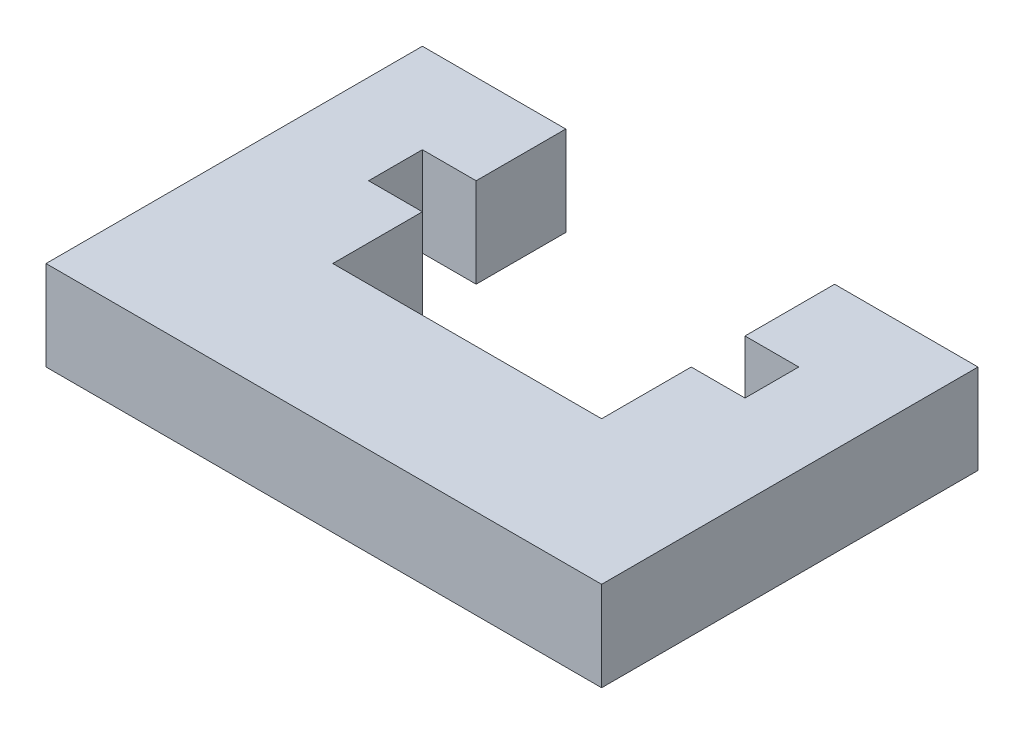
ISO-10303-21;
HEADER;
FILE_DESCRIPTION(('STEP AP214'),'2;1');
FILE_NAME('part.step','',(''),(''),'','','');
FILE_SCHEMA(('AUTOMOTIVE_DESIGN { 1 0 10303 214 1 1 1 1 }'));
ENDSEC;
DATA;
#1=APPLICATION_CONTEXT('core data for automotive mechanical design processes');
#2=APPLICATION_PROTOCOL_DEFINITION('international standard','automotive_design',2000,#1);
#3=PRODUCT_CONTEXT('',#1,'mechanical');
#4=PRODUCT('Part','Part','',(#3));
#5=PRODUCT_RELATED_PRODUCT_CATEGORY('part','',(#4));
#6=PRODUCT_DEFINITION_FORMATION('','',#4);
#7=PRODUCT_DEFINITION_CONTEXT('part definition',#1,'design');
#8=PRODUCT_DEFINITION('design','',#6,#7);
#9=PRODUCT_DEFINITION_SHAPE('','',#8);
#10=(LENGTH_UNIT() NAMED_UNIT(*) SI_UNIT(.MILLI.,.METRE.));
#11=(NAMED_UNIT(*) PLANE_ANGLE_UNIT() SI_UNIT($,.RADIAN.));
#12=(NAMED_UNIT(*) SI_UNIT($,.STERADIAN.) SOLID_ANGLE_UNIT());
#13=UNCERTAINTY_MEASURE_WITH_UNIT(LENGTH_MEASURE(1.E-05),#10,'distance_accuracy_value','');
#14=(GEOMETRIC_REPRESENTATION_CONTEXT(3) GLOBAL_UNCERTAINTY_ASSIGNED_CONTEXT((#13)) GLOBAL_UNIT_ASSIGNED_CONTEXT((#10,
#11,#12)) REPRESENTATION_CONTEXT('',''));
#15=CARTESIAN_POINT('',(0.,0.,0.));
#16=DIRECTION('',(0.,0.,1.));
#17=DIRECTION('',(1.,0.,0.));
#18=AXIS2_PLACEMENT_3D('',#15,#16,#17);
#19=CARTESIAN_POINT('',(23.,5.,-21.));
#20=DIRECTION('',(1.,0.,0.));
#21=DIRECTION('',(0.,0.,-1.));
#22=AXIS2_PLACEMENT_3D('',#19,#20,#21);
#23=PLANE('',#22);
#24=DIRECTION('',(0.,0.,1.));
#25=VECTOR('',#24,1.);
#26=CARTESIAN_POINT('',(23.,5.,-21.));
#27=LINE('',#26,#25);
#28=CARTESIAN_POINT('',(23.,5.,-13.));
#29=VERTEX_POINT('',#28);
#30=CARTESIAN_POINT('',(23.,5.,-8.));
#31=VERTEX_POINT('',#30);
#32=EDGE_CURVE('E262',#29,#31,#27,.T.);
#33=ORIENTED_EDGE('',*,*,#32,.F.);
#34=DIRECTION('',(0.,1.,0.));
#35=VECTOR('',#34,1.);
#36=CARTESIAN_POINT('',(23.,-0.00100000000000013,-13.));
#37=LINE('',#36,#35);
#38=CARTESIAN_POINT('',(23.,0.,-13.));
#39=VERTEX_POINT('',#38);
#40=EDGE_CURVE('E229',#39,#29,#37,.T.);
#41=ORIENTED_EDGE('',*,*,#40,.F.);
#42=DIRECTION('',(0.,0.,1.));
#43=VECTOR('',#42,1.);
#44=CARTESIAN_POINT('',(23.,0.,-21.));
#45=LINE('',#44,#43);
#46=CARTESIAN_POINT('',(23.,0.,-8.));
#47=VERTEX_POINT('',#46);
#48=EDGE_CURVE('E219',#39,#47,#45,.T.);
#49=ORIENTED_EDGE('',*,*,#48,.T.);
#50=DIRECTION('',(0.,-1.,0.));
#51=VECTOR('',#50,1.);
#52=CARTESIAN_POINT('',(23.,5.,-8.));
#53=LINE('',#52,#51);
#54=EDGE_CURVE('E188',#31,#47,#53,.T.);
#55=ORIENTED_EDGE('',*,*,#54,.F.);
#56=EDGE_LOOP('',(#33,#41,#49,#55));
#57=FACE_BOUND('',#56,.T.);
#58=ADVANCED_FACE('F35',(#57),#23,.F.);
#59=CARTESIAN_POINT('',(8.,5.,-8.));
#60=DIRECTION('',(-1.,0.,0.));
#61=DIRECTION('',(0.,0.,1.));
#62=AXIS2_PLACEMENT_3D('',#59,#60,#61);
#63=PLANE('',#62);
#64=DIRECTION('',(0.,0.,-1.));
#65=VECTOR('',#64,1.);
#66=CARTESIAN_POINT('',(8.,5.,-8.));
#67=LINE('',#66,#65);
#68=CARTESIAN_POINT('',(8.00000000000001,5.,-16.));
#69=VERTEX_POINT('',#68);
#70=CARTESIAN_POINT('',(8.,5.,-21.));
#71=VERTEX_POINT('',#70);
#72=EDGE_CURVE('E167',#69,#71,#67,.T.);
#73=ORIENTED_EDGE('',*,*,#72,.F.);
#74=DIRECTION('',(0.,1.,0.));
#75=VECTOR('',#74,1.);
#76=CARTESIAN_POINT('',(8.,-0.00100000000000013,-16.));
#77=LINE('',#76,#75);
#78=CARTESIAN_POINT('',(8.,0.,-16.));
#79=VERTEX_POINT('',#78);
#80=EDGE_CURVE('E152',#79,#69,#77,.T.);
#81=ORIENTED_EDGE('',*,*,#80,.F.);
#82=DIRECTION('',(0.,0.,-1.));
#83=VECTOR('',#82,1.);
#84=CARTESIAN_POINT('',(8.,0.,-8.));
#85=LINE('',#84,#83);
#86=CARTESIAN_POINT('',(8.,0.,-21.));
#87=VERTEX_POINT('',#86);
#88=EDGE_CURVE('E165',#79,#87,#85,.T.);
#89=ORIENTED_EDGE('',*,*,#88,.T.);
#90=DIRECTION('',(0.,-1.,0.));
#91=VECTOR('',#90,1.);
#92=CARTESIAN_POINT('',(8.,5.,-21.));
#93=LINE('',#92,#91);
#94=EDGE_CURVE('E182',#71,#87,#93,.T.);
#95=ORIENTED_EDGE('',*,*,#94,.F.);
#96=EDGE_LOOP('',(#73,#81,#89,#95));
#97=FACE_BOUND('',#96,.T.);
#98=ADVANCED_FACE('F163',(#97),#63,.F.);
#99=CARTESIAN_POINT('',(8.,5.,-21.));
#100=DIRECTION('',(0.,0.,1.));
#101=DIRECTION('',(1.,0.,0.));
#102=AXIS2_PLACEMENT_3D('',#99,#100,#101);
#103=PLANE('',#102);
#104=DIRECTION('',(-1.,0.,0.));
#105=VECTOR('',#104,1.);
#106=CARTESIAN_POINT('',(8.,0.,-21.));
#107=LINE('',#106,#105);
#108=CARTESIAN_POINT('',(0.,0.,-21.));
#109=VERTEX_POINT('',#108);
#110=EDGE_CURVE('E158',#87,#109,#107,.T.);
#111=ORIENTED_EDGE('',*,*,#110,.T.);
#112=DIRECTION('',(0.,-1.,0.));
#113=VECTOR('',#112,1.);
#114=CARTESIAN_POINT('',(0.,5.,-21.));
#115=LINE('',#114,#113);
#116=CARTESIAN_POINT('',(0.,5.,-21.));
#117=VERTEX_POINT('',#116);
#118=EDGE_CURVE('E11',#117,#109,#115,.T.);
#119=ORIENTED_EDGE('',*,*,#118,.F.);
#120=DIRECTION('',(-1.,0.,0.));
#121=VECTOR('',#120,1.);
#122=CARTESIAN_POINT('',(8.,5.,-21.));
#123=LINE('',#122,#121);
#124=EDGE_CURVE('E177',#71,#117,#123,.T.);
#125=ORIENTED_EDGE('',*,*,#124,.F.);
#126=ORIENTED_EDGE('',*,*,#94,.T.);
#127=EDGE_LOOP('',(#111,#119,#125,#126));
#128=FACE_BOUND('',#127,.T.);
#129=ADVANCED_FACE('F37',(#128),#103,.F.);
#130=CARTESIAN_POINT('',(0.,5.,-21.));
#131=DIRECTION('',(1.,0.,0.));
#132=DIRECTION('',(0.,0.,-1.));
#133=AXIS2_PLACEMENT_3D('',#130,#131,#132);
#134=PLANE('',#133);
#135=DIRECTION('',(0.,0.,1.));
#136=VECTOR('',#135,1.);
#137=CARTESIAN_POINT('',(0.,0.,-21.));
#138=LINE('',#137,#136);
#139=CARTESIAN_POINT('',(0.,0.,0.));
#140=VERTEX_POINT('',#139);
#141=EDGE_CURVE('E210',#109,#140,#138,.T.);
#142=ORIENTED_EDGE('',*,*,#141,.T.);
#143=DIRECTION('',(0.,-1.,0.));
#144=VECTOR('',#143,1.);
#145=CARTESIAN_POINT('',(0.,5.,0.));
#146=LINE('',#145,#144);
#147=CARTESIAN_POINT('',(0.,5.,0.));
#148=VERTEX_POINT('',#147);
#149=EDGE_CURVE('E43',#148,#140,#146,.T.);
#150=ORIENTED_EDGE('',*,*,#149,.F.);
#151=DIRECTION('',(0.,0.,1.));
#152=VECTOR('',#151,1.);
#153=CARTESIAN_POINT('',(0.,5.,-21.));
#154=LINE('',#153,#152);
#155=EDGE_CURVE('E251',#117,#148,#154,.T.);
#156=ORIENTED_EDGE('',*,*,#155,.F.);
#157=ORIENTED_EDGE('',*,*,#118,.T.);
#158=EDGE_LOOP('',(#142,#150,#156,#157));
#159=FACE_BOUND('',#158,.T.);
#160=ADVANCED_FACE('F339',(#159),#134,.F.);
#161=CARTESIAN_POINT('',(0.,5.,0.));
#162=DIRECTION('',(0.,0.,-1.));
#163=DIRECTION('',(-1.,0.,0.));
#164=AXIS2_PLACEMENT_3D('',#161,#162,#163);
#165=PLANE('',#164);
#166=DIRECTION('',(1.,0.,0.));
#167=VECTOR('',#166,1.);
#168=CARTESIAN_POINT('',(0.,0.,0.));
#169=LINE('',#168,#167);
#170=CARTESIAN_POINT('',(31.,0.,0.));
#171=VERTEX_POINT('',#170);
#172=EDGE_CURVE('E206',#140,#171,#169,.T.);
#173=ORIENTED_EDGE('',*,*,#172,.T.);
#174=DIRECTION('',(0.,-1.,0.));
#175=VECTOR('',#174,1.);
#176=CARTESIAN_POINT('',(31.,5.,0.));
#177=LINE('',#176,#175);
#178=CARTESIAN_POINT('',(31.,5.,0.));
#179=VERTEX_POINT('',#178);
#180=EDGE_CURVE('E197',#179,#171,#177,.T.);
#181=ORIENTED_EDGE('',*,*,#180,.F.);
#182=DIRECTION('',(1.,0.,0.));
#183=VECTOR('',#182,1.);
#184=CARTESIAN_POINT('',(0.,5.,0.));
#185=LINE('',#184,#183);
#186=EDGE_CURVE('E207',#148,#179,#185,.T.);
#187=ORIENTED_EDGE('',*,*,#186,.F.);
#188=ORIENTED_EDGE('',*,*,#149,.T.);
#189=EDGE_LOOP('',(#173,#181,#187,#188));
#190=FACE_BOUND('',#189,.T.);
#191=ADVANCED_FACE('F204',(#190),#165,.F.);
#192=CARTESIAN_POINT('',(31.,5.,0.));
#193=DIRECTION('',(-1.,0.,0.));
#194=DIRECTION('',(0.,0.,1.));
#195=AXIS2_PLACEMENT_3D('',#192,#193,#194);
#196=PLANE('',#195);
#197=DIRECTION('',(0.,0.,-1.));
#198=VECTOR('',#197,1.);
#199=CARTESIAN_POINT('',(31.,0.,0.));
#200=LINE('',#199,#198);
#201=CARTESIAN_POINT('',(31.,0.,-21.));
#202=VERTEX_POINT('',#201);
#203=EDGE_CURVE('E212',#171,#202,#200,.T.);
#204=ORIENTED_EDGE('',*,*,#203,.T.);
#205=DIRECTION('',(0.,-1.,0.));
#206=VECTOR('',#205,1.);
#207=CARTESIAN_POINT('',(31.,5.,-21.));
#208=LINE('',#207,#206);
#209=CARTESIAN_POINT('',(31.,5.,-21.));
#210=VERTEX_POINT('',#209);
#211=EDGE_CURVE('E194',#210,#202,#208,.T.);
#212=ORIENTED_EDGE('',*,*,#211,.F.);
#213=DIRECTION('',(0.,0.,-1.));
#214=VECTOR('',#213,1.);
#215=CARTESIAN_POINT('',(31.,5.,0.));
#216=LINE('',#215,#214);
#217=EDGE_CURVE('E259',#179,#210,#216,.T.);
#218=ORIENTED_EDGE('',*,*,#217,.F.);
#219=ORIENTED_EDGE('',*,*,#180,.T.);
#220=EDGE_LOOP('',(#204,#212,#218,#219));
#221=FACE_BOUND('',#220,.T.);
#222=ADVANCED_FACE('F330',(#221),#196,.F.);
#223=CARTESIAN_POINT('',(31.,5.,-21.));
#224=DIRECTION('',(0.,0.,1.));
#225=DIRECTION('',(1.,0.,0.));
#226=AXIS2_PLACEMENT_3D('',#223,#224,#225);
#227=PLANE('',#226);
#228=DIRECTION('',(-1.,0.,0.));
#229=VECTOR('',#228,1.);
#230=CARTESIAN_POINT('',(31.,0.,-21.));
#231=LINE('',#230,#229);
#232=CARTESIAN_POINT('',(23.,0.,-21.));
#233=VERTEX_POINT('',#232);
#234=EDGE_CURVE('E214',#202,#233,#231,.T.);
#235=ORIENTED_EDGE('',*,*,#234,.T.);
#236=DIRECTION('',(0.,-1.,0.));
#237=VECTOR('',#236,1.);
#238=CARTESIAN_POINT('',(23.,5.,-21.));
#239=LINE('',#238,#237);
#240=CARTESIAN_POINT('',(23.,5.,-21.));
#241=VERTEX_POINT('',#240);
#242=EDGE_CURVE('E191',#241,#233,#239,.T.);
#243=ORIENTED_EDGE('',*,*,#242,.F.);
#244=DIRECTION('',(-1.,0.,0.));
#245=VECTOR('',#244,1.);
#246=CARTESIAN_POINT('',(31.,5.,-21.));
#247=LINE('',#246,#245);
#248=EDGE_CURVE('E261',#210,#241,#247,.T.);
#249=ORIENTED_EDGE('',*,*,#248,.F.);
#250=ORIENTED_EDGE('',*,*,#211,.T.);
#251=EDGE_LOOP('',(#235,#243,#249,#250));
#252=FACE_BOUND('',#251,.T.);
#253=ADVANCED_FACE('F325',(#252),#227,.F.);
#254=CARTESIAN_POINT('',(23.,0.,-16.));
#255=VERTEX_POINT('',#254);
#256=EDGE_CURVE('E178',#233,#255,#45,.T.);
#257=ORIENTED_EDGE('',*,*,#256,.T.);
#258=DIRECTION('',(0.,-1.,0.));
#259=VECTOR('',#258,1.);
#260=CARTESIAN_POINT('',(23.,-0.00100000000000013,-16.));
#261=LINE('',#260,#259);
#262=CARTESIAN_POINT('',(23.,5.,-16.));
#263=VERTEX_POINT('',#262);
#264=EDGE_CURVE('E50',#263,#255,#261,.T.);
#265=ORIENTED_EDGE('',*,*,#264,.F.);
#266=EDGE_CURVE('E263',#241,#263,#27,.T.);
#267=ORIENTED_EDGE('',*,*,#266,.F.);
#268=ORIENTED_EDGE('',*,*,#242,.T.);
#269=EDGE_LOOP('',(#257,#265,#267,#268));
#270=FACE_BOUND('',#269,.T.);
#271=ADVANCED_FACE('F317',(#270),#23,.F.);
#272=CARTESIAN_POINT('',(23.,5.,-8.));
#273=DIRECTION('',(0.,0.,1.));
#274=DIRECTION('',(1.,0.,0.));
#275=AXIS2_PLACEMENT_3D('',#272,#273,#274);
#276=PLANE('',#275);
#277=DIRECTION('',(-1.,0.,0.));
#278=VECTOR('',#277,1.);
#279=CARTESIAN_POINT('',(23.,0.,-8.));
#280=LINE('',#279,#278);
#281=CARTESIAN_POINT('',(8.,0.,-8.));
#282=VERTEX_POINT('',#281);
#283=EDGE_CURVE('E174',#47,#282,#280,.T.);
#284=ORIENTED_EDGE('',*,*,#283,.T.);
#285=DIRECTION('',(0.,-1.,0.));
#286=VECTOR('',#285,1.);
#287=CARTESIAN_POINT('',(8.,5.,-8.));
#288=LINE('',#287,#286);
#289=CARTESIAN_POINT('',(8.,5.,-8.));
#290=VERTEX_POINT('',#289);
#291=EDGE_CURVE('E184',#290,#282,#288,.T.);
#292=ORIENTED_EDGE('',*,*,#291,.F.);
#293=DIRECTION('',(-1.,0.,0.));
#294=VECTOR('',#293,1.);
#295=CARTESIAN_POINT('',(23.,5.,-8.));
#296=LINE('',#295,#294);
#297=EDGE_CURVE('E235',#31,#290,#296,.T.);
#298=ORIENTED_EDGE('',*,*,#297,.F.);
#299=ORIENTED_EDGE('',*,*,#54,.T.);
#300=EDGE_LOOP('',(#284,#292,#298,#299));
#301=FACE_BOUND('',#300,.T.);
#302=ADVANCED_FACE('F233',(#301),#276,.F.);
#303=CARTESIAN_POINT('',(8.,0.,-13.));
#304=VERTEX_POINT('',#303);
#305=EDGE_CURVE('E173',#282,#304,#85,.T.);
#306=ORIENTED_EDGE('',*,*,#305,.T.);
#307=DIRECTION('',(0.,-1.,0.));
#308=VECTOR('',#307,1.);
#309=CARTESIAN_POINT('',(8.,-0.00100000000000013,-13.));
#310=LINE('',#309,#308);
#311=CARTESIAN_POINT('',(8.,5.,-13.));
#312=VERTEX_POINT('',#311);
#313=EDGE_CURVE('E58',#312,#304,#310,.T.);
#314=ORIENTED_EDGE('',*,*,#313,.F.);
#315=EDGE_CURVE('E185',#290,#312,#67,.T.);
#316=ORIENTED_EDGE('',*,*,#315,.F.);
#317=ORIENTED_EDGE('',*,*,#291,.T.);
#318=EDGE_LOOP('',(#306,#314,#316,#317));
#319=FACE_BOUND('',#318,.T.);
#320=ADVANCED_FACE('F239',(#319),#63,.F.);
#321=CARTESIAN_POINT('',(0.,5.,0.));
#322=DIRECTION('',(0.,1.,0.));
#323=DIRECTION('',(0.,0.,1.));
#324=AXIS2_PLACEMENT_3D('',#321,#322,#323);
#325=PLANE('',#324);
#326=DIRECTION('',(-1.,0.,0.));
#327=VECTOR('',#326,1.);
#328=CARTESIAN_POINT('',(26.,5.,-16.));
#329=LINE('',#328,#327);
#330=CARTESIAN_POINT('',(5.,5.,-16.));
#331=VERTEX_POINT('',#330);
#332=EDGE_CURVE('E296',#69,#331,#329,.T.);
#333=ORIENTED_EDGE('',*,*,#332,.F.);
#334=ORIENTED_EDGE('',*,*,#72,.T.);
#335=ORIENTED_EDGE('',*,*,#124,.T.);
#336=ORIENTED_EDGE('',*,*,#155,.T.);
#337=ORIENTED_EDGE('',*,*,#186,.T.);
#338=ORIENTED_EDGE('',*,*,#217,.T.);
#339=ORIENTED_EDGE('',*,*,#248,.T.);
#340=ORIENTED_EDGE('',*,*,#266,.T.);
#341=DIRECTION('',(-1.,0.,0.));
#342=VECTOR('',#341,1.);
#343=CARTESIAN_POINT('',(26.,5.,-16.));
#344=LINE('',#343,#342);
#345=CARTESIAN_POINT('',(26.,5.,-16.));
#346=VERTEX_POINT('',#345);
#347=EDGE_CURVE('E276',#346,#263,#344,.T.);
#348=ORIENTED_EDGE('',*,*,#347,.F.);
#349=DIRECTION('',(0.,0.,-1.));
#350=VECTOR('',#349,1.);
#351=CARTESIAN_POINT('',(26.,5.,-16.));
#352=LINE('',#351,#350);
#353=CARTESIAN_POINT('',(26.,5.,-13.));
#354=VERTEX_POINT('',#353);
#355=EDGE_CURVE('E273',#354,#346,#352,.T.);
#356=ORIENTED_EDGE('',*,*,#355,.F.);
#357=DIRECTION('',(1.,0.,0.));
#358=VECTOR('',#357,1.);
#359=CARTESIAN_POINT('',(26.,5.,-13.));
#360=LINE('',#359,#358);
#361=EDGE_CURVE('E271',#29,#354,#360,.T.);
#362=ORIENTED_EDGE('',*,*,#361,.F.);
#363=ORIENTED_EDGE('',*,*,#32,.T.);
#364=ORIENTED_EDGE('',*,*,#297,.T.);
#365=ORIENTED_EDGE('',*,*,#315,.T.);
#366=DIRECTION('',(1.,0.,0.));
#367=VECTOR('',#366,1.);
#368=CARTESIAN_POINT('',(26.,5.,-13.));
#369=LINE('',#368,#367);
#370=CARTESIAN_POINT('',(5.,5.,-13.));
#371=VERTEX_POINT('',#370);
#372=EDGE_CURVE('E290',#371,#312,#369,.T.);
#373=ORIENTED_EDGE('',*,*,#372,.F.);
#374=DIRECTION('',(0.,0.,1.));
#375=VECTOR('',#374,1.);
#376=CARTESIAN_POINT('',(5.,5.,-16.));
#377=LINE('',#376,#375);
#378=EDGE_CURVE('E293',#331,#371,#377,.T.);
#379=ORIENTED_EDGE('',*,*,#378,.F.);
#380=EDGE_LOOP('',(#333,#334,#335,#336,#337,#338,#339,#340,#348,#356,#362,#363,#364,#365,#373,#379));
#381=FACE_BOUND('',#380,.T.);
#382=ADVANCED_FACE('F268',(#381),#325,.T.);
#383=CARTESIAN_POINT('',(0.,0.,0.));
#384=DIRECTION('',(0.,1.,0.));
#385=DIRECTION('',(0.,0.,1.));
#386=AXIS2_PLACEMENT_3D('',#383,#384,#385);
#387=PLANE('',#386);
#388=ORIENTED_EDGE('',*,*,#88,.F.);
#389=DIRECTION('',(1.,0.,0.));
#390=VECTOR('',#389,1.);
#391=CARTESIAN_POINT('',(26.,0.,-16.));
#392=LINE('',#391,#390);
#393=CARTESIAN_POINT('',(5.,0.,-16.));
#394=VERTEX_POINT('',#393);
#395=EDGE_CURVE('E148',#394,#79,#392,.T.);
#396=ORIENTED_EDGE('',*,*,#395,.F.);
#397=DIRECTION('',(0.,0.,-1.));
#398=VECTOR('',#397,1.);
#399=CARTESIAN_POINT('',(5.,0.,-16.));
#400=LINE('',#399,#398);
#401=CARTESIAN_POINT('',(5.,0.,-13.));
#402=VERTEX_POINT('',#401);
#403=EDGE_CURVE('E298',#402,#394,#400,.T.);
#404=ORIENTED_EDGE('',*,*,#403,.F.);
#405=DIRECTION('',(-1.,0.,0.));
#406=VECTOR('',#405,1.);
#407=CARTESIAN_POINT('',(26.,0.,-13.));
#408=LINE('',#407,#406);
#409=EDGE_CURVE('E237',#304,#402,#408,.T.);
#410=ORIENTED_EDGE('',*,*,#409,.F.);
#411=ORIENTED_EDGE('',*,*,#305,.F.);
#412=ORIENTED_EDGE('',*,*,#283,.F.);
#413=ORIENTED_EDGE('',*,*,#48,.F.);
#414=DIRECTION('',(-1.,0.,0.));
#415=VECTOR('',#414,1.);
#416=CARTESIAN_POINT('',(26.,0.,-13.));
#417=LINE('',#416,#415);
#418=CARTESIAN_POINT('',(26.,0.,-13.));
#419=VERTEX_POINT('',#418);
#420=EDGE_CURVE('E255',#419,#39,#417,.T.);
#421=ORIENTED_EDGE('',*,*,#420,.F.);
#422=DIRECTION('',(0.,0.,1.));
#423=VECTOR('',#422,1.);
#424=CARTESIAN_POINT('',(26.,0.,-16.));
#425=LINE('',#424,#423);
#426=CARTESIAN_POINT('',(26.,0.,-16.));
#427=VERTEX_POINT('',#426);
#428=EDGE_CURVE('E283',#427,#419,#425,.T.);
#429=ORIENTED_EDGE('',*,*,#428,.F.);
#430=DIRECTION('',(1.,0.,0.));
#431=VECTOR('',#430,1.);
#432=CARTESIAN_POINT('',(26.,0.,-16.));
#433=LINE('',#432,#431);
#434=EDGE_CURVE('E168',#255,#427,#433,.T.);
#435=ORIENTED_EDGE('',*,*,#434,.F.);
#436=ORIENTED_EDGE('',*,*,#256,.F.);
#437=ORIENTED_EDGE('',*,*,#234,.F.);
#438=ORIENTED_EDGE('',*,*,#203,.F.);
#439=ORIENTED_EDGE('',*,*,#172,.F.);
#440=ORIENTED_EDGE('',*,*,#141,.F.);
#441=ORIENTED_EDGE('',*,*,#110,.F.);
#442=EDGE_LOOP('',(#388,#396,#404,#410,#411,#412,#413,#421,#429,#435,#436,#437,#438,#439,#440,#441));
#443=FACE_BOUND('',#442,.T.);
#444=ADVANCED_FACE('F171',(#443),#387,.F.);
#445=CARTESIAN_POINT('',(26.,-0.00100000000000013,-16.));
#446=DIRECTION('',(1.,0.,0.));
#447=DIRECTION('',(0.,0.,-1.));
#448=AXIS2_PLACEMENT_3D('',#445,#446,#447);
#449=PLANE('',#448);
#450=ORIENTED_EDGE('',*,*,#428,.T.);
#451=DIRECTION('',(0.,1.,0.));
#452=VECTOR('',#451,1.);
#453=CARTESIAN_POINT('',(26.,-0.00100000000000013,-13.));
#454=LINE('',#453,#452);
#455=EDGE_CURVE('E279',#419,#354,#454,.T.);
#456=ORIENTED_EDGE('',*,*,#455,.T.);
#457=ORIENTED_EDGE('',*,*,#355,.T.);
#458=DIRECTION('',(0.,1.,0.));
#459=VECTOR('',#458,1.);
#460=CARTESIAN_POINT('',(26.,-0.00100000000000013,-16.));
#461=LINE('',#460,#459);
#462=EDGE_CURVE('E287',#427,#346,#461,.T.);
#463=ORIENTED_EDGE('',*,*,#462,.F.);
#464=EDGE_LOOP('',(#450,#456,#457,#463));
#465=FACE_BOUND('',#464,.T.);
#466=ADVANCED_FACE('F351',(#465),#449,.F.);
#467=CARTESIAN_POINT('',(26.,-0.00100000000000013,-13.));
#468=DIRECTION('',(0.,0.,1.));
#469=DIRECTION('',(1.,0.,0.));
#470=AXIS2_PLACEMENT_3D('',#467,#468,#469);
#471=PLANE('',#470);
#472=ORIENTED_EDGE('',*,*,#40,.T.);
#473=ORIENTED_EDGE('',*,*,#361,.T.);
#474=ORIENTED_EDGE('',*,*,#455,.F.);
#475=ORIENTED_EDGE('',*,*,#420,.T.);
#476=EDGE_LOOP('',(#472,#473,#474,#475));
#477=FACE_BOUND('',#476,.T.);
#478=ADVANCED_FACE('F352',(#477),#471,.F.);
#479=CARTESIAN_POINT('',(26.,-0.00100000000000013,-16.));
#480=DIRECTION('',(0.,0.,-1.));
#481=DIRECTION('',(-1.,0.,0.));
#482=AXIS2_PLACEMENT_3D('',#479,#480,#481);
#483=PLANE('',#482);
#484=ORIENTED_EDGE('',*,*,#264,.T.);
#485=ORIENTED_EDGE('',*,*,#434,.T.);
#486=ORIENTED_EDGE('',*,*,#462,.T.);
#487=ORIENTED_EDGE('',*,*,#347,.T.);
#488=EDGE_LOOP('',(#484,#485,#486,#487));
#489=FACE_BOUND('',#488,.T.);
#490=ADVANCED_FACE('F313',(#489),#483,.F.);
#491=CARTESIAN_POINT('',(26.,-0.00100000000000013,-16.));
#492=DIRECTION('',(0.,0.,-1.));
#493=DIRECTION('',(-1.,0.,0.));
#494=AXIS2_PLACEMENT_3D('',#491,#492,#493);
#495=PLANE('',#494);
#496=ORIENTED_EDGE('',*,*,#80,.T.);
#497=ORIENTED_EDGE('',*,*,#332,.T.);
#498=DIRECTION('',(0.,1.,0.));
#499=VECTOR('',#498,1.);
#500=CARTESIAN_POINT('',(5.,-0.00100000000000013,-16.));
#501=LINE('',#500,#499);
#502=EDGE_CURVE('E154',#394,#331,#501,.T.);
#503=ORIENTED_EDGE('',*,*,#502,.F.);
#504=ORIENTED_EDGE('',*,*,#395,.T.);
#505=EDGE_LOOP('',(#496,#497,#503,#504));
#506=FACE_BOUND('',#505,.T.);
#507=ADVANCED_FACE('F150',(#506),#495,.F.);
#508=CARTESIAN_POINT('',(5.,-0.00100000000000013,-16.));
#509=DIRECTION('',(-1.,0.,0.));
#510=DIRECTION('',(0.,0.,1.));
#511=AXIS2_PLACEMENT_3D('',#508,#509,#510);
#512=PLANE('',#511);
#513=ORIENTED_EDGE('',*,*,#403,.T.);
#514=ORIENTED_EDGE('',*,*,#502,.T.);
#515=ORIENTED_EDGE('',*,*,#378,.T.);
#516=DIRECTION('',(0.,1.,0.));
#517=VECTOR('',#516,1.);
#518=CARTESIAN_POINT('',(5.,-0.00100000000000013,-13.));
#519=LINE('',#518,#517);
#520=EDGE_CURVE('E159',#402,#371,#519,.T.);
#521=ORIENTED_EDGE('',*,*,#520,.F.);
#522=EDGE_LOOP('',(#513,#514,#515,#521));
#523=FACE_BOUND('',#522,.T.);
#524=ADVANCED_FACE('F304',(#523),#512,.F.);
#525=CARTESIAN_POINT('',(26.,-0.00100000000000013,-13.));
#526=DIRECTION('',(0.,0.,1.));
#527=DIRECTION('',(1.,0.,0.));
#528=AXIS2_PLACEMENT_3D('',#525,#526,#527);
#529=PLANE('',#528);
#530=ORIENTED_EDGE('',*,*,#313,.T.);
#531=ORIENTED_EDGE('',*,*,#409,.T.);
#532=ORIENTED_EDGE('',*,*,#520,.T.);
#533=ORIENTED_EDGE('',*,*,#372,.T.);
#534=EDGE_LOOP('',(#530,#531,#532,#533));
#535=FACE_BOUND('',#534,.T.);
#536=ADVANCED_FACE('F302',(#535),#529,.F.);
#537=CLOSED_SHELL('',(#58,#98,#129,#160,#191,#222,#253,#271,#302,#320,#382,#444,#466,#478,#490,
#507,#524,#536));
#538=MANIFOLD_SOLID_BREP('B2',#537);
#539=ADVANCED_BREP_SHAPE_REPRESENTATION('',(#18,#538),#14);
#540=SHAPE_DEFINITION_REPRESENTATION(#9,#539);
ENDSEC;
END-ISO-10303-21;
